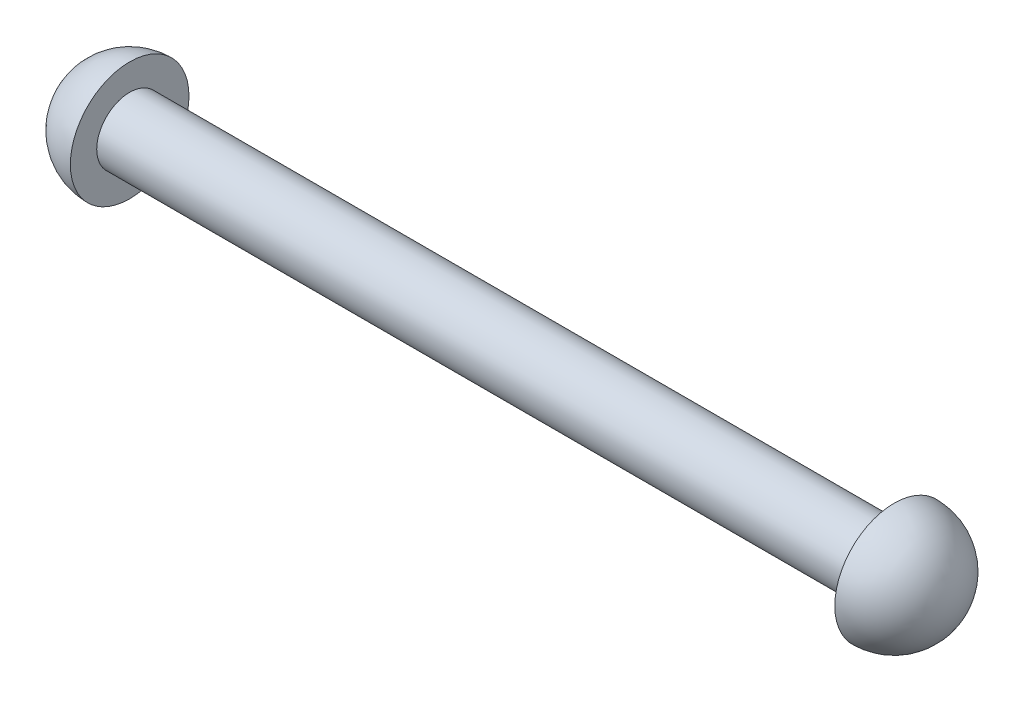
ISO-10303-21;
HEADER;
FILE_DESCRIPTION(('STEP AP214'),'2;1');
FILE_NAME('part.step','',(''),(''),'','','');
FILE_SCHEMA(('AUTOMOTIVE_DESIGN { 1 0 10303 214 1 1 1 1 }'));
ENDSEC;
DATA;
#1=APPLICATION_CONTEXT('core data for automotive mechanical design processes');
#2=APPLICATION_PROTOCOL_DEFINITION('international standard','automotive_design',2000,#1);
#3=PRODUCT_CONTEXT('',#1,'mechanical');
#4=PRODUCT('Part','Part','',(#3));
#5=PRODUCT_RELATED_PRODUCT_CATEGORY('part','',(#4));
#6=PRODUCT_DEFINITION_FORMATION('','',#4);
#7=PRODUCT_DEFINITION_CONTEXT('part definition',#1,'design');
#8=PRODUCT_DEFINITION('design','',#6,#7);
#9=PRODUCT_DEFINITION_SHAPE('','',#8);
#10=(LENGTH_UNIT() NAMED_UNIT(*) SI_UNIT(.MILLI.,.METRE.));
#11=(NAMED_UNIT(*) PLANE_ANGLE_UNIT() SI_UNIT($,.RADIAN.));
#12=(NAMED_UNIT(*) SI_UNIT($,.STERADIAN.) SOLID_ANGLE_UNIT());
#13=UNCERTAINTY_MEASURE_WITH_UNIT(LENGTH_MEASURE(1.E-05),#10,'distance_accuracy_value','');
#14=(GEOMETRIC_REPRESENTATION_CONTEXT(3) GLOBAL_UNCERTAINTY_ASSIGNED_CONTEXT((#13)) GLOBAL_UNIT_ASSIGNED_CONTEXT((#10,
#11,#12)) REPRESENTATION_CONTEXT('',''));
#15=CARTESIAN_POINT('',(0.,0.,0.));
#16=DIRECTION('',(0.,0.,1.));
#17=DIRECTION('',(1.,0.,0.));
#18=AXIS2_PLACEMENT_3D('',#15,#16,#17);
#19=CARTESIAN_POINT('',(-36.83,0.,0.));
#20=DIRECTION('',(-1.,0.,0.));
#21=DIRECTION('',(0.,0.,-1.));
#22=AXIS2_PLACEMENT_3D('',#19,#20,#21);
#23=SPHERICAL_SURFACE('',#22,5.715);
#24=CARTESIAN_POINT('',(-36.83,0.,0.));
#25=DIRECTION('',(-1.,0.,0.));
#26=DIRECTION('',(0.,0.,1.));
#27=AXIS2_PLACEMENT_3D('',#24,#25,#26);
#28=CIRCLE('',#27,5.715);
#29=CARTESIAN_POINT('',(-36.83,0.,5.715));
#30=VERTEX_POINT('',#29);
#31=EDGE_CURVE('E10',#30,#30,#28,.T.);
#32=ORIENTED_EDGE('',*,*,#31,.T.);
#33=EDGE_LOOP('',(#32));
#34=FACE_BOUND('',#33,.T.);
#35=ADVANCED_FACE('F43',(#34),#23,.T.);
#36=CARTESIAN_POINT('',(-36.83,0.,0.));
#37=DIRECTION('',(-1.,0.,0.));
#38=DIRECTION('',(0.,0.,1.));
#39=AXIS2_PLACEMENT_3D('',#36,#37,#38);
#40=PLANE('',#39);
#41=ORIENTED_EDGE('',*,*,#31,.F.);
#42=EDGE_LOOP('',(#41));
#43=FACE_BOUND('',#42,.T.);
#44=CARTESIAN_POINT('',(-36.83,0.,0.));
#45=DIRECTION('',(-1.,0.,0.));
#46=DIRECTION('',(0.,0.,1.));
#47=AXIS2_PLACEMENT_3D('',#44,#45,#46);
#48=CIRCLE('',#47,3.175);
#49=CARTESIAN_POINT('',(-36.83,0.,3.175));
#50=VERTEX_POINT('',#49);
#51=EDGE_CURVE('E50',#50,#50,#48,.T.);
#52=ORIENTED_EDGE('',*,*,#51,.T.);
#53=EDGE_LOOP('',(#52));
#54=FACE_BOUND('',#53,.T.);
#55=ADVANCED_FACE('F79',(#43,#54),#40,.F.);
#56=CARTESIAN_POINT('',(-36.83,0.,0.));
#57=DIRECTION('',(-1.,0.,0.));
#58=DIRECTION('',(0.,0.,1.));
#59=AXIS2_PLACEMENT_3D('',#56,#57,#58);
#60=CYLINDRICAL_SURFACE('',#59,3.175);
#61=CARTESIAN_POINT('',(36.83,0.,0.));
#62=DIRECTION('',(-1.,0.,0.));
#63=DIRECTION('',(0.,0.,1.));
#64=AXIS2_PLACEMENT_3D('',#61,#62,#63);
#65=CIRCLE('',#64,3.175);
#66=CARTESIAN_POINT('',(36.83,0.,3.175));
#67=VERTEX_POINT('',#66);
#68=EDGE_CURVE('E55',#67,#67,#65,.T.);
#69=ORIENTED_EDGE('',*,*,#68,.T.);
#70=EDGE_LOOP('',(#69));
#71=FACE_BOUND('',#70,.T.);
#72=ORIENTED_EDGE('',*,*,#51,.F.);
#73=EDGE_LOOP('',(#72));
#74=FACE_BOUND('',#73,.T.);
#75=ADVANCED_FACE('F76',(#71,#74),#60,.T.);
#76=CARTESIAN_POINT('',(36.83,0.,0.));
#77=DIRECTION('',(-1.,0.,0.));
#78=DIRECTION('',(0.,0.,1.));
#79=AXIS2_PLACEMENT_3D('',#76,#77,#78);
#80=PLANE('',#79);
#81=CARTESIAN_POINT('',(36.83,0.,0.));
#82=DIRECTION('',(-1.,0.,0.));
#83=DIRECTION('',(0.,0.,1.));
#84=AXIS2_PLACEMENT_3D('',#81,#82,#83);
#85=CIRCLE('',#84,5.715);
#86=CARTESIAN_POINT('',(36.83,0.,5.715));
#87=VERTEX_POINT('',#86);
#88=EDGE_CURVE('E60',#87,#87,#85,.T.);
#89=ORIENTED_EDGE('',*,*,#88,.T.);
#90=EDGE_LOOP('',(#89));
#91=FACE_BOUND('',#90,.T.);
#92=ORIENTED_EDGE('',*,*,#68,.F.);
#93=EDGE_LOOP('',(#92));
#94=FACE_BOUND('',#93,.T.);
#95=ADVANCED_FACE('F67',(#91,#94),#80,.T.);
#96=CARTESIAN_POINT('',(36.83,0.,0.));
#97=DIRECTION('',(-1.,0.,0.));
#98=DIRECTION('',(0.,0.,-1.));
#99=AXIS2_PLACEMENT_3D('',#96,#97,#98);
#100=SPHERICAL_SURFACE('',#99,5.715);
#101=ORIENTED_EDGE('',*,*,#88,.F.);
#102=EDGE_LOOP('',(#101));
#103=FACE_BOUND('',#102,.T.);
#104=ADVANCED_FACE('F70',(#103),#100,.T.);
#105=CLOSED_SHELL('',(#35,#55,#75,#95,#104));
#106=MANIFOLD_SOLID_BREP('B2',#105);
#107=ADVANCED_BREP_SHAPE_REPRESENTATION('',(#18,#106),#14);
#108=SHAPE_DEFINITION_REPRESENTATION(#9,#107);
ENDSEC;
END-ISO-10303-21;
